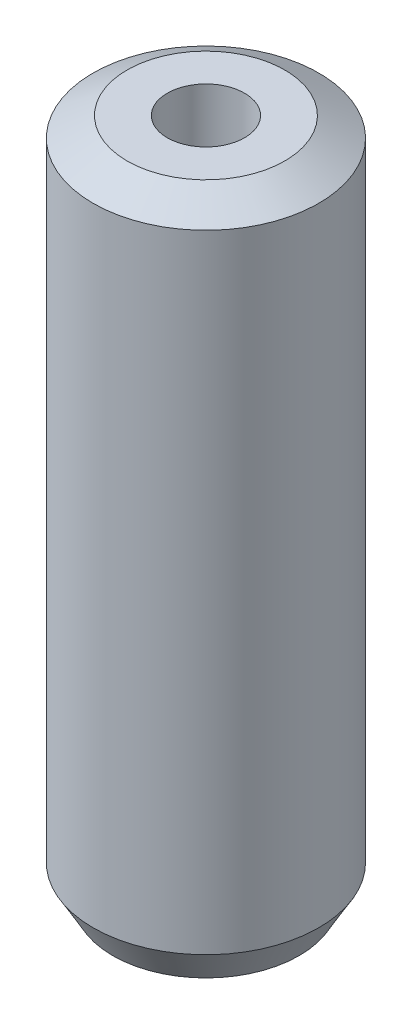
ISO-10303-21;
HEADER;
FILE_DESCRIPTION(('STEP AP214'),'2;1');
FILE_NAME('part.step','',(''),(''),'','','');
FILE_SCHEMA(('AUTOMOTIVE_DESIGN { 1 0 10303 214 1 1 1 1 }'));
ENDSEC;
DATA;
#1=APPLICATION_CONTEXT('core data for automotive mechanical design processes');
#2=APPLICATION_PROTOCOL_DEFINITION('international standard','automotive_design',2000,#1);
#3=PRODUCT_CONTEXT('',#1,'mechanical');
#4=PRODUCT('Part','Part','',(#3));
#5=PRODUCT_RELATED_PRODUCT_CATEGORY('part','',(#4));
#6=PRODUCT_DEFINITION_FORMATION('','',#4);
#7=PRODUCT_DEFINITION_CONTEXT('part definition',#1,'design');
#8=PRODUCT_DEFINITION('design','',#6,#7);
#9=PRODUCT_DEFINITION_SHAPE('','',#8);
#10=(LENGTH_UNIT() NAMED_UNIT(*) SI_UNIT(.MILLI.,.METRE.));
#11=(NAMED_UNIT(*) PLANE_ANGLE_UNIT() SI_UNIT($,.RADIAN.));
#12=(NAMED_UNIT(*) SI_UNIT($,.STERADIAN.) SOLID_ANGLE_UNIT());
#13=UNCERTAINTY_MEASURE_WITH_UNIT(LENGTH_MEASURE(1.E-05),#10,'distance_accuracy_value','');
#14=(GEOMETRIC_REPRESENTATION_CONTEXT(3) GLOBAL_UNCERTAINTY_ASSIGNED_CONTEXT((#13)) GLOBAL_UNIT_ASSIGNED_CONTEXT((#10,
#11,#12)) REPRESENTATION_CONTEXT('',''));
#15=CARTESIAN_POINT('',(0.,0.,0.));
#16=DIRECTION('',(0.,0.,1.));
#17=DIRECTION('',(1.,0.,0.));
#18=AXIS2_PLACEMENT_3D('',#15,#16,#17);
#19=CARTESIAN_POINT('',(0.,105.594713805124,0.));
#20=DIRECTION('',(0.,-1.,0.));
#21=DIRECTION('',(0.,0.,-1.));
#22=AXIS2_PLACEMENT_3D('',#19,#20,#21);
#23=CYLINDRICAL_SURFACE('',#22,17.5);
#24=CARTESIAN_POINT('',(0.,102.55011153447,0.));
#25=DIRECTION('',(0.,1.,0.));
#26=DIRECTION('',(0.,0.,1.));
#27=AXIS2_PLACEMENT_3D('',#24,#25,#26);
#28=CIRCLE('',#27,17.5);
#29=CARTESIAN_POINT('',(0.,102.55011153447,17.5));
#30=VERTEX_POINT('',#29);
#31=EDGE_CURVE('E50',#30,#30,#28,.F.);
#32=ORIENTED_EDGE('',*,*,#31,.T.);
#33=EDGE_LOOP('',(#32));
#34=FACE_BOUND('',#33,.T.);
#35=CARTESIAN_POINT('',(0.,5.27340582161266,0.));
#36=DIRECTION('',(0.,1.,0.));
#37=DIRECTION('',(0.,0.,1.));
#38=AXIS2_PLACEMENT_3D('',#35,#36,#37);
#39=CIRCLE('',#38,17.5);
#40=CARTESIAN_POINT('',(0.,5.27340582161266,17.5));
#41=VERTEX_POINT('',#40);
#42=EDGE_CURVE('E51',#41,#41,#39,.T.);
#43=ORIENTED_EDGE('',*,*,#42,.T.);
#44=EDGE_LOOP('',(#43));
#45=FACE_BOUND('',#44,.T.);
#46=ADVANCED_FACE('F39',(#34,#45),#23,.T.);
#47=CARTESIAN_POINT('',(0.,105.594713805124,0.));
#48=DIRECTION('',(0.,1.,0.));
#49=DIRECTION('',(0.,0.,1.));
#50=AXIS2_PLACEMENT_3D('',#47,#48,#49);
#51=PLANE('',#50);
#52=CARTESIAN_POINT('',(0.,105.594713805124,0.));
#53=DIRECTION('',(0.,1.,0.));
#54=DIRECTION('',(0.,0.,1.));
#55=AXIS2_PLACEMENT_3D('',#52,#53,#54);
#56=CIRCLE('',#55,12.2265941783873);
#57=CARTESIAN_POINT('',(0.,105.594713805124,12.2265941783873));
#58=VERTEX_POINT('',#57);
#59=EDGE_CURVE('E54',#58,#58,#56,.T.);
#60=ORIENTED_EDGE('',*,*,#59,.T.);
#61=EDGE_LOOP('',(#60));
#62=FACE_BOUND('',#61,.T.);
#63=CARTESIAN_POINT('',(0.,105.594713805124,0.));
#64=DIRECTION('',(0.,1.,0.));
#65=DIRECTION('',(0.,0.,1.));
#66=AXIS2_PLACEMENT_3D('',#63,#64,#65);
#67=CIRCLE('',#66,5.99241948652125);
#68=CARTESIAN_POINT('',(0.,105.594713805124,5.99241948652125));
#69=VERTEX_POINT('',#68);
#70=EDGE_CURVE('E58',#69,#69,#67,.T.);
#71=ORIENTED_EDGE('',*,*,#70,.F.);
#72=EDGE_LOOP('',(#71));
#73=FACE_BOUND('',#72,.T.);
#74=ADVANCED_FACE('F69',(#62,#73),#51,.T.);
#75=CARTESIAN_POINT('',(0.,0.,0.));
#76=DIRECTION('',(0.,1.,0.));
#77=DIRECTION('',(0.,0.,1.));
#78=AXIS2_PLACEMENT_3D('',#75,#76,#77);
#79=PLANE('',#78);
#80=CARTESIAN_POINT('',(0.,0.,0.));
#81=DIRECTION('',(0.,1.,0.));
#82=DIRECTION('',(0.,0.,1.));
#83=AXIS2_PLACEMENT_3D('',#80,#81,#82);
#84=CIRCLE('',#83,14.4553977293458);
#85=CARTESIAN_POINT('',(0.,0.,14.4553977293458));
#86=VERTEX_POINT('',#85);
#87=EDGE_CURVE('E10',#86,#86,#84,.F.);
#88=ORIENTED_EDGE('',*,*,#87,.T.);
#89=EDGE_LOOP('',(#88));
#90=FACE_BOUND('',#89,.T.);
#91=CARTESIAN_POINT('',(0.,0.,0.));
#92=DIRECTION('',(0.,1.,0.));
#93=DIRECTION('',(0.,0.,1.));
#94=AXIS2_PLACEMENT_3D('',#91,#92,#93);
#95=CIRCLE('',#94,5.99241948652125);
#96=CARTESIAN_POINT('',(0.,0.,5.99241948652125));
#97=VERTEX_POINT('',#96);
#98=EDGE_CURVE('E63',#97,#97,#95,.T.);
#99=ORIENTED_EDGE('',*,*,#98,.T.);
#100=EDGE_LOOP('',(#99));
#101=FACE_BOUND('',#100,.T.);
#102=ADVANCED_FACE('F75',(#90,#101),#79,.F.);
#103=CARTESIAN_POINT('',(0.,105.594713805124,0.));
#104=DIRECTION('',(0.,-1.,0.));
#105=DIRECTION('',(0.,0.,-1.));
#106=AXIS2_PLACEMENT_3D('',#103,#104,#105);
#107=CYLINDRICAL_SURFACE('',#106,5.99241948652125);
#108=ORIENTED_EDGE('',*,*,#70,.T.);
#109=EDGE_LOOP('',(#108));
#110=FACE_BOUND('',#109,.T.);
#111=ORIENTED_EDGE('',*,*,#98,.F.);
#112=EDGE_LOOP('',(#111));
#113=FACE_BOUND('',#112,.T.);
#114=ADVANCED_FACE('F70',(#110,#113),#107,.F.);
#115=CARTESIAN_POINT('',(0.,105.594713805124,0.));
#116=DIRECTION('',(0.,-1.,0.));
#117=DIRECTION('',(0.,0.,-1.));
#118=AXIS2_PLACEMENT_3D('',#115,#116,#117);
#119=CONICAL_SURFACE('',#118,12.2265941783873,1.0471975511966);
#120=ORIENTED_EDGE('',*,*,#31,.F.);
#121=EDGE_LOOP('',(#120));
#122=FACE_BOUND('',#121,.T.);
#123=ORIENTED_EDGE('',*,*,#59,.F.);
#124=EDGE_LOOP('',(#123));
#125=FACE_BOUND('',#124,.T.);
#126=ADVANCED_FACE('F81',(#122,#125),#119,.T.);
#127=CARTESIAN_POINT('',(0.,5.27340582161266,0.));
#128=DIRECTION('',(0.,1.,0.));
#129=DIRECTION('',(0.,0.,1.));
#130=AXIS2_PLACEMENT_3D('',#127,#128,#129);
#131=CONICAL_SURFACE('',#130,17.5,0.523598775598302);
#132=ORIENTED_EDGE('',*,*,#87,.F.);
#133=EDGE_LOOP('',(#132));
#134=FACE_BOUND('',#133,.T.);
#135=ORIENTED_EDGE('',*,*,#42,.F.);
#136=EDGE_LOOP('',(#135));
#137=FACE_BOUND('',#136,.T.);
#138=ADVANCED_FACE('F45',(#134,#137),#131,.T.);
#139=CLOSED_SHELL('',(#46,#74,#102,#114,#126,#138));
#140=MANIFOLD_SOLID_BREP('B2',#139);
#141=ADVANCED_BREP_SHAPE_REPRESENTATION('',(#18,#140),#14);
#142=SHAPE_DEFINITION_REPRESENTATION(#9,#141);
ENDSEC;
END-ISO-10303-21;
